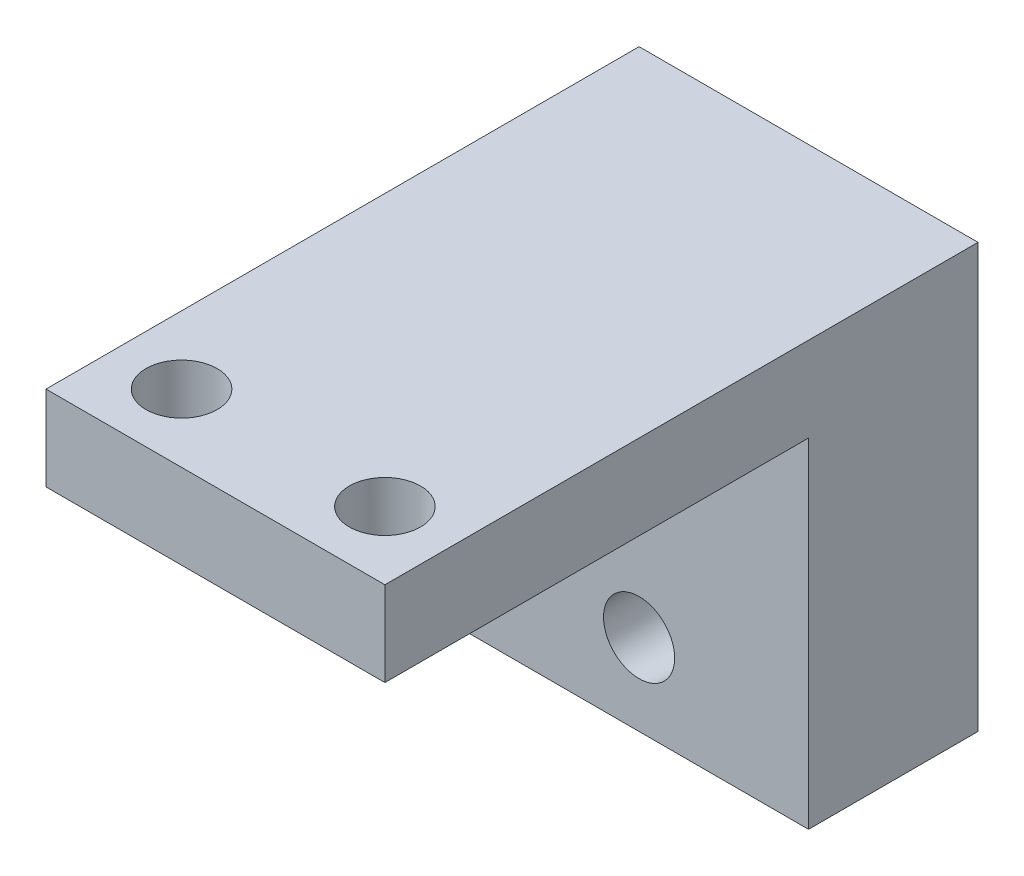
ISO-10303-21;
HEADER;
FILE_DESCRIPTION(('STEP AP214'),'2;1');
FILE_NAME('part.step','',(''),(''),'','','');
FILE_SCHEMA(('AUTOMOTIVE_DESIGN { 1 0 10303 214 1 1 1 1 }'));
ENDSEC;
DATA;
#1=APPLICATION_CONTEXT('core data for automotive mechanical design processes');
#2=APPLICATION_PROTOCOL_DEFINITION('international standard','automotive_design',2000,#1);
#3=PRODUCT_CONTEXT('',#1,'mechanical');
#4=PRODUCT('Part','Part','',(#3));
#5=PRODUCT_RELATED_PRODUCT_CATEGORY('part','',(#4));
#6=PRODUCT_DEFINITION_FORMATION('','',#4);
#7=PRODUCT_DEFINITION_CONTEXT('part definition',#1,'design');
#8=PRODUCT_DEFINITION('design','',#6,#7);
#9=PRODUCT_DEFINITION_SHAPE('','',#8);
#10=(LENGTH_UNIT() NAMED_UNIT(*) SI_UNIT(.MILLI.,.METRE.));
#11=(NAMED_UNIT(*) PLANE_ANGLE_UNIT() SI_UNIT($,.RADIAN.));
#12=(NAMED_UNIT(*) SI_UNIT($,.STERADIAN.) SOLID_ANGLE_UNIT());
#13=UNCERTAINTY_MEASURE_WITH_UNIT(LENGTH_MEASURE(1.E-05),#10,'distance_accuracy_value','');
#14=(GEOMETRIC_REPRESENTATION_CONTEXT(3) GLOBAL_UNCERTAINTY_ASSIGNED_CONTEXT((#13)) GLOBAL_UNIT_ASSIGNED_CONTEXT((#10,
#11,#12)) REPRESENTATION_CONTEXT('',''));
#15=CARTESIAN_POINT('',(0.,0.,0.));
#16=DIRECTION('',(0.,0.,1.));
#17=DIRECTION('',(1.,0.,0.));
#18=AXIS2_PLACEMENT_3D('',#15,#16,#17);
#19=CARTESIAN_POINT('',(0.,0.,10.));
#20=DIRECTION('',(0.,0.,1.));
#21=DIRECTION('',(1.,0.,0.));
#22=AXIS2_PLACEMENT_3D('',#19,#20,#21);
#23=PLANE('',#22);
#24=DIRECTION('',(1.,0.,0.));
#25=VECTOR('',#24,1.);
#26=CARTESIAN_POINT('',(-10.,10.,10.));
#27=LINE('',#26,#25);
#28=CARTESIAN_POINT('',(-10.,10.,10.));
#29=VERTEX_POINT('',#28);
#30=CARTESIAN_POINT('',(10.,10.,10.));
#31=VERTEX_POINT('',#30);
#32=EDGE_CURVE('E79',#29,#31,#27,.T.);
#33=ORIENTED_EDGE('',*,*,#32,.F.);
#34=DIRECTION('',(0.,1.,0.));
#35=VECTOR('',#34,1.);
#36=CARTESIAN_POINT('',(-10.,-10.,10.));
#37=LINE('',#36,#35);
#38=CARTESIAN_POINT('',(-10.,-10.,10.));
#39=VERTEX_POINT('',#38);
#40=EDGE_CURVE('E122',#39,#29,#37,.T.);
#41=ORIENTED_EDGE('',*,*,#40,.F.);
#42=DIRECTION('',(-1.,0.,0.));
#43=VECTOR('',#42,1.);
#44=CARTESIAN_POINT('',(10.,-9.99999999999999,10.));
#45=LINE('',#44,#43);
#46=CARTESIAN_POINT('',(10.,-9.99999999999999,10.));
#47=VERTEX_POINT('',#46);
#48=EDGE_CURVE('E106',#47,#39,#45,.T.);
#49=ORIENTED_EDGE('',*,*,#48,.F.);
#50=DIRECTION('',(0.,1.,0.));
#51=VECTOR('',#50,1.);
#52=CARTESIAN_POINT('',(10.,-9.99999999999999,10.));
#53=LINE('',#52,#51);
#54=EDGE_CURVE('E104',#47,#31,#53,.T.);
#55=ORIENTED_EDGE('',*,*,#54,.T.);
#56=EDGE_LOOP('',(#33,#41,#49,#55));
#57=FACE_BOUND('',#56,.T.);
#58=CARTESIAN_POINT('',(0.,-5.2,10.));
#59=DIRECTION('',(0.,0.,1.));
#60=DIRECTION('',(1.,0.,0.));
#61=AXIS2_PLACEMENT_3D('',#58,#59,#60);
#62=CIRCLE('',#61,2.1);
#63=CARTESIAN_POINT('',(2.1,-5.2,10.));
#64=VERTEX_POINT('',#63);
#65=EDGE_CURVE('E117',#64,#64,#62,.T.);
#66=ORIENTED_EDGE('',*,*,#65,.F.);
#67=EDGE_LOOP('',(#66));
#68=FACE_BOUND('',#67,.T.);
#69=CARTESIAN_POINT('',(0.,5.2,10.));
#70=DIRECTION('',(0.,0.,1.));
#71=DIRECTION('',(1.,0.,0.));
#72=AXIS2_PLACEMENT_3D('',#69,#70,#71);
#73=CIRCLE('',#72,2.1);
#74=CARTESIAN_POINT('',(2.1,5.2,10.));
#75=VERTEX_POINT('',#74);
#76=EDGE_CURVE('E131',#75,#75,#73,.T.);
#77=ORIENTED_EDGE('',*,*,#76,.F.);
#78=EDGE_LOOP('',(#77));
#79=FACE_BOUND('',#78,.T.);
#80=ADVANCED_FACE('F64',(#57,#68,#79),#23,.T.);
#81=CARTESIAN_POINT('',(0.,0.,0.));
#82=DIRECTION('',(0.,0.,1.));
#83=DIRECTION('',(1.,0.,0.));
#84=AXIS2_PLACEMENT_3D('',#81,#82,#83);
#85=PLANE('',#84);
#86=DIRECTION('',(0.,1.,0.));
#87=VECTOR('',#86,1.);
#88=CARTESIAN_POINT('',(10.,-9.99999999999999,0.));
#89=LINE('',#88,#87);
#90=CARTESIAN_POINT('',(10.,-9.99999999999999,0.));
#91=VERTEX_POINT('',#90);
#92=CARTESIAN_POINT('',(10.,15.,0.));
#93=VERTEX_POINT('',#92);
#94=EDGE_CURVE('E101',#91,#93,#89,.T.);
#95=ORIENTED_EDGE('',*,*,#94,.F.);
#96=DIRECTION('',(-1.,0.,0.));
#97=VECTOR('',#96,1.);
#98=CARTESIAN_POINT('',(10.,-9.99999999999999,0.));
#99=LINE('',#98,#97);
#100=CARTESIAN_POINT('',(-10.,-10.,0.));
#101=VERTEX_POINT('',#100);
#102=EDGE_CURVE('E113',#91,#101,#99,.T.);
#103=ORIENTED_EDGE('',*,*,#102,.T.);
#104=DIRECTION('',(0.,1.,0.));
#105=VECTOR('',#104,1.);
#106=CARTESIAN_POINT('',(-10.,-10.,0.));
#107=LINE('',#106,#105);
#108=CARTESIAN_POINT('',(-10.,15.,0.));
#109=VERTEX_POINT('',#108);
#110=EDGE_CURVE('E116',#101,#109,#107,.T.);
#111=ORIENTED_EDGE('',*,*,#110,.T.);
#112=DIRECTION('',(-1.,0.,0.));
#113=VECTOR('',#112,1.);
#114=CARTESIAN_POINT('',(-10.,15.,0.));
#115=LINE('',#114,#113);
#116=EDGE_CURVE('E115',#93,#109,#115,.T.);
#117=ORIENTED_EDGE('',*,*,#116,.F.);
#118=EDGE_LOOP('',(#95,#103,#111,#117));
#119=FACE_BOUND('',#118,.T.);
#120=CARTESIAN_POINT('',(0.,-5.2,0.));
#121=DIRECTION('',(0.,0.,1.));
#122=DIRECTION('',(1.,0.,0.));
#123=AXIS2_PLACEMENT_3D('',#120,#121,#122);
#124=CIRCLE('',#123,2.1);
#125=CARTESIAN_POINT('',(2.1,-5.2,0.));
#126=VERTEX_POINT('',#125);
#127=EDGE_CURVE('E128',#126,#126,#124,.T.);
#128=ORIENTED_EDGE('',*,*,#127,.T.);
#129=EDGE_LOOP('',(#128));
#130=FACE_BOUND('',#129,.T.);
#131=CARTESIAN_POINT('',(0.,5.2,0.));
#132=DIRECTION('',(0.,0.,1.));
#133=DIRECTION('',(1.,0.,0.));
#134=AXIS2_PLACEMENT_3D('',#131,#132,#133);
#135=CIRCLE('',#134,2.1);
#136=CARTESIAN_POINT('',(2.1,5.2,0.));
#137=VERTEX_POINT('',#136);
#138=EDGE_CURVE('E134',#137,#137,#135,.T.);
#139=ORIENTED_EDGE('',*,*,#138,.T.);
#140=EDGE_LOOP('',(#139));
#141=FACE_BOUND('',#140,.T.);
#142=ADVANCED_FACE('F110',(#119,#130,#141),#85,.F.);
#143=CARTESIAN_POINT('',(10.,-9.99999999999999,10.));
#144=DIRECTION('',(-1.,0.,0.));
#145=DIRECTION('',(0.,0.,1.));
#146=AXIS2_PLACEMENT_3D('',#143,#144,#145);
#147=PLANE('',#146);
#148=ORIENTED_EDGE('',*,*,#94,.T.);
#149=DIRECTION('',(0.,0.,-1.));
#150=VECTOR('',#149,1.);
#151=CARTESIAN_POINT('',(10.,15.,0.));
#152=LINE('',#151,#150);
#153=CARTESIAN_POINT('',(10.,15.,35.));
#154=VERTEX_POINT('',#153);
#155=EDGE_CURVE('E140',#154,#93,#152,.T.);
#156=ORIENTED_EDGE('',*,*,#155,.F.);
#157=DIRECTION('',(0.,1.,0.));
#158=VECTOR('',#157,1.);
#159=CARTESIAN_POINT('',(10.,15.,35.));
#160=LINE('',#159,#158);
#161=CARTESIAN_POINT('',(10.,10.,35.));
#162=VERTEX_POINT('',#161);
#163=EDGE_CURVE('E156',#162,#154,#160,.T.);
#164=ORIENTED_EDGE('',*,*,#163,.F.);
#165=DIRECTION('',(0.,0.,-1.));
#166=VECTOR('',#165,1.);
#167=CARTESIAN_POINT('',(10.,10.,35.));
#168=LINE('',#167,#166);
#169=EDGE_CURVE('E148',#162,#31,#168,.T.);
#170=ORIENTED_EDGE('',*,*,#169,.T.);
#171=ORIENTED_EDGE('',*,*,#54,.F.);
#172=DIRECTION('',(0.,0.,-1.));
#173=VECTOR('',#172,1.);
#174=CARTESIAN_POINT('',(10.,-9.99999999999999,10.));
#175=LINE('',#174,#173);
#176=EDGE_CURVE('E72',#47,#91,#175,.T.);
#177=ORIENTED_EDGE('',*,*,#176,.T.);
#178=EDGE_LOOP('',(#148,#156,#164,#170,#171,#177));
#179=FACE_BOUND('',#178,.T.);
#180=ADVANCED_FACE('F66',(#179),#147,.F.);
#181=CARTESIAN_POINT('',(-10.,-10.,10.));
#182=DIRECTION('',(-1.,0.,0.));
#183=DIRECTION('',(0.,0.,1.));
#184=AXIS2_PLACEMENT_3D('',#181,#182,#183);
#185=PLANE('',#184);
#186=ORIENTED_EDGE('',*,*,#110,.F.);
#187=DIRECTION('',(0.,0.,-1.));
#188=VECTOR('',#187,1.);
#189=CARTESIAN_POINT('',(-10.,-10.,10.));
#190=LINE('',#189,#188);
#191=EDGE_CURVE('E12',#39,#101,#190,.T.);
#192=ORIENTED_EDGE('',*,*,#191,.F.);
#193=ORIENTED_EDGE('',*,*,#40,.T.);
#194=DIRECTION('',(0.,0.,-1.));
#195=VECTOR('',#194,1.);
#196=CARTESIAN_POINT('',(-10.,10.,35.));
#197=LINE('',#196,#195);
#198=CARTESIAN_POINT('',(-10.,10.,35.));
#199=VERTEX_POINT('',#198);
#200=EDGE_CURVE('E145',#199,#29,#197,.T.);
#201=ORIENTED_EDGE('',*,*,#200,.F.);
#202=DIRECTION('',(0.,-1.,0.));
#203=VECTOR('',#202,1.);
#204=CARTESIAN_POINT('',(-10.,15.,35.));
#205=LINE('',#204,#203);
#206=CARTESIAN_POINT('',(-10.,15.,35.));
#207=VERTEX_POINT('',#206);
#208=EDGE_CURVE('E152',#207,#199,#205,.T.);
#209=ORIENTED_EDGE('',*,*,#208,.F.);
#210=DIRECTION('',(0.,0.,1.));
#211=VECTOR('',#210,1.);
#212=CARTESIAN_POINT('',(-10.,15.,0.));
#213=LINE('',#212,#211);
#214=EDGE_CURVE('E142',#109,#207,#213,.T.);
#215=ORIENTED_EDGE('',*,*,#214,.F.);
#216=EDGE_LOOP('',(#186,#192,#193,#201,#209,#215));
#217=FACE_BOUND('',#216,.T.);
#218=ADVANCED_FACE('F205',(#217),#185,.T.);
#219=CARTESIAN_POINT('',(10.,-9.99999999999999,10.));
#220=DIRECTION('',(0.,-1.,0.));
#221=DIRECTION('',(1.,0.,0.));
#222=AXIS2_PLACEMENT_3D('',#219,#220,#221);
#223=PLANE('',#222);
#224=ORIENTED_EDGE('',*,*,#102,.F.);
#225=ORIENTED_EDGE('',*,*,#176,.F.);
#226=ORIENTED_EDGE('',*,*,#48,.T.);
#227=ORIENTED_EDGE('',*,*,#191,.T.);
#228=EDGE_LOOP('',(#224,#225,#226,#227));
#229=FACE_BOUND('',#228,.T.);
#230=ADVANCED_FACE('F119',(#229),#223,.T.);
#231=CARTESIAN_POINT('',(0.,-5.2,10.));
#232=DIRECTION('',(0.,0.,-1.));
#233=DIRECTION('',(-1.,0.,0.));
#234=AXIS2_PLACEMENT_3D('',#231,#232,#233);
#235=CYLINDRICAL_SURFACE('',#234,2.1);
#236=ORIENTED_EDGE('',*,*,#65,.T.);
#237=EDGE_LOOP('',(#236));
#238=FACE_BOUND('',#237,.T.);
#239=ORIENTED_EDGE('',*,*,#127,.F.);
#240=EDGE_LOOP('',(#239));
#241=FACE_BOUND('',#240,.T.);
#242=ADVANCED_FACE('F218',(#238,#241),#235,.F.);
#243=CARTESIAN_POINT('',(0.,5.2,10.));
#244=DIRECTION('',(0.,0.,-1.));
#245=DIRECTION('',(-1.,0.,0.));
#246=AXIS2_PLACEMENT_3D('',#243,#244,#245);
#247=CYLINDRICAL_SURFACE('',#246,2.1);
#248=ORIENTED_EDGE('',*,*,#76,.T.);
#249=EDGE_LOOP('',(#248));
#250=FACE_BOUND('',#249,.T.);
#251=ORIENTED_EDGE('',*,*,#138,.F.);
#252=EDGE_LOOP('',(#251));
#253=FACE_BOUND('',#252,.T.);
#254=ADVANCED_FACE('F215',(#250,#253),#247,.F.);
#255=CARTESIAN_POINT('',(0.,15.,0.));
#256=DIRECTION('',(0.,1.,0.));
#257=DIRECTION('',(-1.,0.,0.));
#258=AXIS2_PLACEMENT_3D('',#255,#256,#257);
#259=PLANE('',#258);
#260=CARTESIAN_POINT('',(-6.,15.,31.));
#261=DIRECTION('',(0.,1.,0.));
#262=DIRECTION('',(-1.,0.,0.));
#263=AXIS2_PLACEMENT_3D('',#260,#261,#262);
#264=CIRCLE('',#263,2.1);
#265=CARTESIAN_POINT('',(-8.1,15.,31.));
#266=VERTEX_POINT('',#265);
#267=EDGE_CURVE('E153',#266,#266,#264,.T.);
#268=ORIENTED_EDGE('',*,*,#267,.F.);
#269=EDGE_LOOP('',(#268));
#270=FACE_BOUND('',#269,.T.);
#271=CARTESIAN_POINT('',(6.,15.,31.));
#272=DIRECTION('',(0.,1.,0.));
#273=DIRECTION('',(-1.,0.,0.));
#274=AXIS2_PLACEMENT_3D('',#271,#272,#273);
#275=CIRCLE('',#274,2.1);
#276=CARTESIAN_POINT('',(3.9,15.,31.));
#277=VERTEX_POINT('',#276);
#278=EDGE_CURVE('E166',#277,#277,#275,.T.);
#279=ORIENTED_EDGE('',*,*,#278,.F.);
#280=EDGE_LOOP('',(#279));
#281=FACE_BOUND('',#280,.T.);
#282=ORIENTED_EDGE('',*,*,#214,.T.);
#283=DIRECTION('',(-1.,0.,0.));
#284=VECTOR('',#283,1.);
#285=CARTESIAN_POINT('',(-10.,15.,35.));
#286=LINE('',#285,#284);
#287=EDGE_CURVE('E150',#154,#207,#286,.T.);
#288=ORIENTED_EDGE('',*,*,#287,.F.);
#289=ORIENTED_EDGE('',*,*,#155,.T.);
#290=ORIENTED_EDGE('',*,*,#116,.T.);
#291=EDGE_LOOP('',(#282,#288,#289,#290));
#292=FACE_BOUND('',#291,.T.);
#293=ADVANCED_FACE('F182',(#270,#281,#292),#259,.T.);
#294=CARTESIAN_POINT('',(-10.,10.,35.));
#295=DIRECTION('',(0.,1.,0.));
#296=DIRECTION('',(0.,0.,1.));
#297=AXIS2_PLACEMENT_3D('',#294,#295,#296);
#298=PLANE('',#297);
#299=CARTESIAN_POINT('',(-6.,10.,31.));
#300=DIRECTION('',(0.,-1.,0.));
#301=DIRECTION('',(0.,0.,-1.));
#302=AXIS2_PLACEMENT_3D('',#299,#300,#301);
#303=CIRCLE('',#302,2.1);
#304=CARTESIAN_POINT('',(-6.,10.,28.9));
#305=VERTEX_POINT('',#304);
#306=EDGE_CURVE('E169',#305,#305,#303,.T.);
#307=ORIENTED_EDGE('',*,*,#306,.F.);
#308=EDGE_LOOP('',(#307));
#309=FACE_BOUND('',#308,.T.);
#310=CARTESIAN_POINT('',(6.,10.,31.));
#311=DIRECTION('',(0.,-1.,0.));
#312=DIRECTION('',(0.,0.,-1.));
#313=AXIS2_PLACEMENT_3D('',#310,#311,#312);
#314=CIRCLE('',#313,2.1);
#315=CARTESIAN_POINT('',(6.,10.,28.9));
#316=VERTEX_POINT('',#315);
#317=EDGE_CURVE('E170',#316,#316,#314,.T.);
#318=ORIENTED_EDGE('',*,*,#317,.F.);
#319=EDGE_LOOP('',(#318));
#320=FACE_BOUND('',#319,.T.);
#321=ORIENTED_EDGE('',*,*,#32,.T.);
#322=ORIENTED_EDGE('',*,*,#169,.F.);
#323=DIRECTION('',(1.,0.,0.));
#324=VECTOR('',#323,1.);
#325=CARTESIAN_POINT('',(-10.,10.,35.));
#326=LINE('',#325,#324);
#327=EDGE_CURVE('E159',#199,#162,#326,.T.);
#328=ORIENTED_EDGE('',*,*,#327,.F.);
#329=ORIENTED_EDGE('',*,*,#200,.T.);
#330=EDGE_LOOP('',(#321,#322,#328,#329));
#331=FACE_BOUND('',#330,.T.);
#332=ADVANCED_FACE('F178',(#309,#320,#331),#298,.F.);
#333=CARTESIAN_POINT('',(0.,0.,35.));
#334=DIRECTION('',(0.,0.,1.));
#335=DIRECTION('',(1.,0.,0.));
#336=AXIS2_PLACEMENT_3D('',#333,#334,#335);
#337=PLANE('',#336);
#338=ORIENTED_EDGE('',*,*,#208,.T.);
#339=ORIENTED_EDGE('',*,*,#327,.T.);
#340=ORIENTED_EDGE('',*,*,#163,.T.);
#341=ORIENTED_EDGE('',*,*,#287,.T.);
#342=EDGE_LOOP('',(#338,#339,#340,#341));
#343=FACE_BOUND('',#342,.T.);
#344=ADVANCED_FACE('F181',(#343),#337,.T.);
#345=CARTESIAN_POINT('',(6.,35.,31.));
#346=DIRECTION('',(0.,-1.,0.));
#347=DIRECTION('',(0.,0.,-1.));
#348=AXIS2_PLACEMENT_3D('',#345,#346,#347);
#349=CYLINDRICAL_SURFACE('',#348,2.1);
#350=ORIENTED_EDGE('',*,*,#278,.T.);
#351=EDGE_LOOP('',(#350));
#352=FACE_BOUND('',#351,.T.);
#353=ORIENTED_EDGE('',*,*,#317,.T.);
#354=EDGE_LOOP('',(#353));
#355=FACE_BOUND('',#354,.T.);
#356=ADVANCED_FACE('F273',(#352,#355),#349,.F.);
#357=CARTESIAN_POINT('',(-6.,35.,31.));
#358=DIRECTION('',(0.,-1.,0.));
#359=DIRECTION('',(0.,0.,-1.));
#360=AXIS2_PLACEMENT_3D('',#357,#358,#359);
#361=CYLINDRICAL_SURFACE('',#360,2.1);
#362=ORIENTED_EDGE('',*,*,#267,.T.);
#363=EDGE_LOOP('',(#362));
#364=FACE_BOUND('',#363,.T.);
#365=ORIENTED_EDGE('',*,*,#306,.T.);
#366=EDGE_LOOP('',(#365));
#367=FACE_BOUND('',#366,.T.);
#368=ADVANCED_FACE('F176',(#364,#367),#361,.F.);
#369=CLOSED_SHELL('',(#80,#142,#180,#218,#230,#242,#254,#293,#332,#344,#356,#368));
#370=MANIFOLD_SOLID_BREP('B2',#369);
#371=ADVANCED_BREP_SHAPE_REPRESENTATION('',(#18,#370),#14);
#372=SHAPE_DEFINITION_REPRESENTATION(#9,#371);
ENDSEC;
END-ISO-10303-21;
